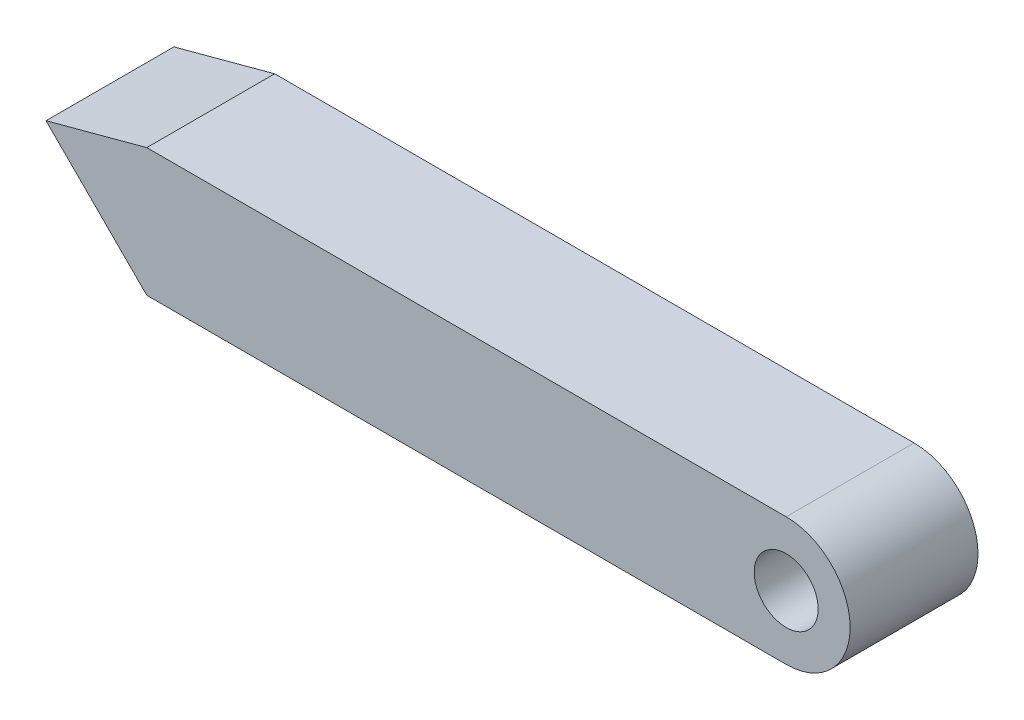
ISO-10303-21;
HEADER;
FILE_DESCRIPTION(('STEP AP214'),'2;1');
FILE_NAME('part.step','',(''),(''),'','','');
FILE_SCHEMA(('AUTOMOTIVE_DESIGN { 1 0 10303 214 1 1 1 1 }'));
ENDSEC;
DATA;
#1=APPLICATION_CONTEXT('core data for automotive mechanical design processes');
#2=APPLICATION_PROTOCOL_DEFINITION('international standard','automotive_design',2000,#1);
#3=PRODUCT_CONTEXT('',#1,'mechanical');
#4=PRODUCT('Part','Part','',(#3));
#5=PRODUCT_RELATED_PRODUCT_CATEGORY('part','',(#4));
#6=PRODUCT_DEFINITION_FORMATION('','',#4);
#7=PRODUCT_DEFINITION_CONTEXT('part definition',#1,'design');
#8=PRODUCT_DEFINITION('design','',#6,#7);
#9=PRODUCT_DEFINITION_SHAPE('','',#8);
#10=(LENGTH_UNIT() NAMED_UNIT(*) SI_UNIT(.MILLI.,.METRE.));
#11=(NAMED_UNIT(*) PLANE_ANGLE_UNIT() SI_UNIT($,.RADIAN.));
#12=(NAMED_UNIT(*) SI_UNIT($,.STERADIAN.) SOLID_ANGLE_UNIT());
#13=UNCERTAINTY_MEASURE_WITH_UNIT(LENGTH_MEASURE(1.E-05),#10,'distance_accuracy_value','');
#14=(GEOMETRIC_REPRESENTATION_CONTEXT(3) GLOBAL_UNCERTAINTY_ASSIGNED_CONTEXT((#13)) GLOBAL_UNIT_ASSIGNED_CONTEXT((#10,
#11,#12)) REPRESENTATION_CONTEXT('',''));
#15=CARTESIAN_POINT('',(0.,0.,0.));
#16=DIRECTION('',(0.,0.,1.));
#17=DIRECTION('',(1.,0.,0.));
#18=AXIS2_PLACEMENT_3D('',#15,#16,#17);
#19=CARTESIAN_POINT('',(0.,0.,10.));
#20=DIRECTION('',(0.,0.,1.));
#21=DIRECTION('',(1.,0.,0.));
#22=AXIS2_PLACEMENT_3D('',#19,#20,#21);
#23=PLANE('',#22);
#24=CARTESIAN_POINT('',(0.,0.,10.));
#25=DIRECTION('',(0.,0.,1.));
#26=DIRECTION('',(1.,0.,0.));
#27=AXIS2_PLACEMENT_3D('',#24,#25,#26);
#28=CIRCLE('',#27,5.);
#29=CARTESIAN_POINT('',(0.,-5.,10.));
#30=VERTEX_POINT('',#29);
#31=CARTESIAN_POINT('',(0.,5.,10.));
#32=VERTEX_POINT('',#31);
#33=EDGE_CURVE('E116',#30,#32,#28,.T.);
#34=ORIENTED_EDGE('',*,*,#33,.T.);
#35=DIRECTION('',(-1.,0.,0.));
#36=VECTOR('',#35,1.);
#37=CARTESIAN_POINT('',(0.,5.,10.));
#38=LINE('',#37,#36);
#39=CARTESIAN_POINT('',(-50.,4.99999999999999,10.));
#40=VERTEX_POINT('',#39);
#41=EDGE_CURVE('E83',#32,#40,#38,.T.);
#42=ORIENTED_EDGE('',*,*,#41,.T.);
#43=DIRECTION('',(-0.965682029009431,-0.259727200824689,0.));
#44=VECTOR('',#43,1.);
#45=CARTESIAN_POINT('',(-50.,4.99999999999999,10.));
#46=LINE('',#45,#44);
#47=CARTESIAN_POINT('',(-57.880486008255,2.88048600825499,10.));
#48=VERTEX_POINT('',#47);
#49=EDGE_CURVE('E87',#40,#48,#46,.T.);
#50=ORIENTED_EDGE('',*,*,#49,.T.);
#51=DIRECTION('',(0.707106781186547,-0.707106781186548,0.));
#52=VECTOR('',#51,1.);
#53=CARTESIAN_POINT('',(-50.,-5.,10.));
#54=LINE('',#53,#52);
#55=CARTESIAN_POINT('',(-50.,-5.,10.));
#56=VERTEX_POINT('',#55);
#57=EDGE_CURVE('E91',#48,#56,#54,.T.);
#58=ORIENTED_EDGE('',*,*,#57,.T.);
#59=DIRECTION('',(1.,0.,0.));
#60=VECTOR('',#59,1.);
#61=CARTESIAN_POINT('',(0.,-5.,10.));
#62=LINE('',#61,#60);
#63=EDGE_CURVE('E49',#56,#30,#62,.T.);
#64=ORIENTED_EDGE('',*,*,#63,.T.);
#65=EDGE_LOOP('',(#34,#42,#50,#58,#64));
#66=FACE_BOUND('',#65,.T.);
#67=CARTESIAN_POINT('',(0.,0.,10.));
#68=DIRECTION('',(0.,0.,1.));
#69=DIRECTION('',(1.,0.,0.));
#70=AXIS2_PLACEMENT_3D('',#67,#68,#69);
#71=CIRCLE('',#70,2.5);
#72=CARTESIAN_POINT('',(2.5,0.,10.));
#73=VERTEX_POINT('',#72);
#74=EDGE_CURVE('E111',#73,#73,#71,.T.);
#75=ORIENTED_EDGE('',*,*,#74,.F.);
#76=EDGE_LOOP('',(#75));
#77=FACE_BOUND('',#76,.T.);
#78=ADVANCED_FACE('F32',(#66,#77),#23,.T.);
#79=CARTESIAN_POINT('',(0.,0.,0.));
#80=DIRECTION('',(0.,0.,1.));
#81=DIRECTION('',(1.,0.,0.));
#82=AXIS2_PLACEMENT_3D('',#79,#80,#81);
#83=PLANE('',#82);
#84=CARTESIAN_POINT('',(0.,0.,0.));
#85=DIRECTION('',(0.,0.,1.));
#86=DIRECTION('',(1.,0.,0.));
#87=AXIS2_PLACEMENT_3D('',#84,#85,#86);
#88=CIRCLE('',#87,5.);
#89=CARTESIAN_POINT('',(0.,-5.,0.));
#90=VERTEX_POINT('',#89);
#91=CARTESIAN_POINT('',(0.,5.,0.));
#92=VERTEX_POINT('',#91);
#93=EDGE_CURVE('E107',#90,#92,#88,.T.);
#94=ORIENTED_EDGE('',*,*,#93,.F.);
#95=DIRECTION('',(1.,0.,0.));
#96=VECTOR('',#95,1.);
#97=CARTESIAN_POINT('',(0.,-5.,0.));
#98=LINE('',#97,#96);
#99=CARTESIAN_POINT('',(-50.,-5.,0.));
#100=VERTEX_POINT('',#99);
#101=EDGE_CURVE('E75',#100,#90,#98,.T.);
#102=ORIENTED_EDGE('',*,*,#101,.F.);
#103=DIRECTION('',(0.707106781186547,-0.707106781186548,0.));
#104=VECTOR('',#103,1.);
#105=CARTESIAN_POINT('',(-50.,-5.,0.));
#106=LINE('',#105,#104);
#107=CARTESIAN_POINT('',(-57.880486008255,2.88048600825499,0.));
#108=VERTEX_POINT('',#107);
#109=EDGE_CURVE('E69',#108,#100,#106,.T.);
#110=ORIENTED_EDGE('',*,*,#109,.F.);
#111=DIRECTION('',(-0.965682029009431,-0.259727200824689,0.));
#112=VECTOR('',#111,1.);
#113=CARTESIAN_POINT('',(-50.,4.99999999999999,0.));
#114=LINE('',#113,#112);
#115=CARTESIAN_POINT('',(-50.,4.99999999999999,0.));
#116=VERTEX_POINT('',#115);
#117=EDGE_CURVE('E98',#116,#108,#114,.T.);
#118=ORIENTED_EDGE('',*,*,#117,.F.);
#119=DIRECTION('',(-1.,0.,0.));
#120=VECTOR('',#119,1.);
#121=CARTESIAN_POINT('',(0.,5.,0.));
#122=LINE('',#121,#120);
#123=EDGE_CURVE('E110',#92,#116,#122,.T.);
#124=ORIENTED_EDGE('',*,*,#123,.F.);
#125=EDGE_LOOP('',(#94,#102,#110,#118,#124));
#126=FACE_BOUND('',#125,.T.);
#127=CARTESIAN_POINT('',(0.,0.,0.));
#128=DIRECTION('',(0.,0.,1.));
#129=DIRECTION('',(1.,0.,0.));
#130=AXIS2_PLACEMENT_3D('',#127,#128,#129);
#131=CIRCLE('',#130,2.5);
#132=CARTESIAN_POINT('',(2.5,0.,0.));
#133=VERTEX_POINT('',#132);
#134=EDGE_CURVE('E196',#133,#133,#131,.T.);
#135=ORIENTED_EDGE('',*,*,#134,.T.);
#136=EDGE_LOOP('',(#135));
#137=FACE_BOUND('',#136,.T.);
#138=ADVANCED_FACE('F120',(#126,#137),#83,.F.);
#139=CARTESIAN_POINT('',(0.,0.,10.));
#140=DIRECTION('',(0.,0.,-1.));
#141=DIRECTION('',(-1.,0.,0.));
#142=AXIS2_PLACEMENT_3D('',#139,#140,#141);
#143=CYLINDRICAL_SURFACE('',#142,5.);
#144=ORIENTED_EDGE('',*,*,#93,.T.);
#145=DIRECTION('',(0.,0.,-1.));
#146=VECTOR('',#145,1.);
#147=CARTESIAN_POINT('',(0.,5.,10.));
#148=LINE('',#147,#146);
#149=EDGE_CURVE('E11',#32,#92,#148,.T.);
#150=ORIENTED_EDGE('',*,*,#149,.F.);
#151=ORIENTED_EDGE('',*,*,#33,.F.);
#152=DIRECTION('',(0.,0.,-1.));
#153=VECTOR('',#152,1.);
#154=CARTESIAN_POINT('',(0.,-5.,10.));
#155=LINE('',#154,#153);
#156=EDGE_CURVE('E103',#30,#90,#155,.T.);
#157=ORIENTED_EDGE('',*,*,#156,.T.);
#158=EDGE_LOOP('',(#144,#150,#151,#157));
#159=FACE_BOUND('',#158,.T.);
#160=ADVANCED_FACE('F34',(#159),#143,.T.);
#161=CARTESIAN_POINT('',(0.,5.,10.));
#162=DIRECTION('',(0.,-1.,0.));
#163=DIRECTION('',(1.,0.,0.));
#164=AXIS2_PLACEMENT_3D('',#161,#162,#163);
#165=PLANE('',#164);
#166=ORIENTED_EDGE('',*,*,#123,.T.);
#167=DIRECTION('',(0.,0.,-1.));
#168=VECTOR('',#167,1.);
#169=CARTESIAN_POINT('',(-50.,4.99999999999999,10.));
#170=LINE('',#169,#168);
#171=EDGE_CURVE('E41',#40,#116,#170,.T.);
#172=ORIENTED_EDGE('',*,*,#171,.F.);
#173=ORIENTED_EDGE('',*,*,#41,.F.);
#174=ORIENTED_EDGE('',*,*,#149,.T.);
#175=EDGE_LOOP('',(#166,#172,#173,#174));
#176=FACE_BOUND('',#175,.T.);
#177=ADVANCED_FACE('F145',(#176),#165,.F.);
#178=CARTESIAN_POINT('',(-50.,4.99999999999999,10.));
#179=DIRECTION('',(0.259727200824689,-0.965682029009431,0.));
#180=DIRECTION('',(0.965682029009431,0.259727200824689,0.));
#181=AXIS2_PLACEMENT_3D('',#178,#179,#180);
#182=PLANE('',#181);
#183=ORIENTED_EDGE('',*,*,#117,.T.);
#184=DIRECTION('',(0.,0.,-1.));
#185=VECTOR('',#184,1.);
#186=CARTESIAN_POINT('',(-57.880486008255,2.88048600825499,10.));
#187=LINE('',#186,#185);
#188=EDGE_CURVE('E95',#48,#108,#187,.T.);
#189=ORIENTED_EDGE('',*,*,#188,.F.);
#190=ORIENTED_EDGE('',*,*,#49,.F.);
#191=ORIENTED_EDGE('',*,*,#171,.T.);
#192=EDGE_LOOP('',(#183,#189,#190,#191));
#193=FACE_BOUND('',#192,.T.);
#194=ADVANCED_FACE('F96',(#193),#182,.F.);
#195=CARTESIAN_POINT('',(-50.,-5.,10.));
#196=DIRECTION('',(0.707106781186548,0.707106781186547,0.));
#197=DIRECTION('',(-0.707106781186547,0.707106781186548,0.));
#198=AXIS2_PLACEMENT_3D('',#195,#196,#197);
#199=PLANE('',#198);
#200=ORIENTED_EDGE('',*,*,#109,.T.);
#201=DIRECTION('',(0.,0.,-1.));
#202=VECTOR('',#201,1.);
#203=CARTESIAN_POINT('',(-50.,-5.,10.));
#204=LINE('',#203,#202);
#205=EDGE_CURVE('E99',#56,#100,#204,.T.);
#206=ORIENTED_EDGE('',*,*,#205,.F.);
#207=ORIENTED_EDGE('',*,*,#57,.F.);
#208=ORIENTED_EDGE('',*,*,#188,.T.);
#209=EDGE_LOOP('',(#200,#206,#207,#208));
#210=FACE_BOUND('',#209,.T.);
#211=ADVANCED_FACE('F101',(#210),#199,.F.);
#212=CARTESIAN_POINT('',(0.,-5.,10.));
#213=DIRECTION('',(0.,1.,0.));
#214=DIRECTION('',(0.,0.,1.));
#215=AXIS2_PLACEMENT_3D('',#212,#213,#214);
#216=PLANE('',#215);
#217=ORIENTED_EDGE('',*,*,#101,.T.);
#218=ORIENTED_EDGE('',*,*,#156,.F.);
#219=ORIENTED_EDGE('',*,*,#63,.F.);
#220=ORIENTED_EDGE('',*,*,#205,.T.);
#221=EDGE_LOOP('',(#217,#218,#219,#220));
#222=FACE_BOUND('',#221,.T.);
#223=ADVANCED_FACE('F125',(#222),#216,.F.);
#224=CARTESIAN_POINT('',(0.,0.,10.));
#225=DIRECTION('',(0.,0.,-1.));
#226=DIRECTION('',(-1.,0.,0.));
#227=AXIS2_PLACEMENT_3D('',#224,#225,#226);
#228=CYLINDRICAL_SURFACE('',#227,2.5);
#229=ORIENTED_EDGE('',*,*,#74,.T.);
#230=EDGE_LOOP('',(#229));
#231=FACE_BOUND('',#230,.T.);
#232=ORIENTED_EDGE('',*,*,#134,.F.);
#233=EDGE_LOOP('',(#232));
#234=FACE_BOUND('',#233,.T.);
#235=ADVANCED_FACE('F127',(#231,#234),#228,.F.);
#236=CLOSED_SHELL('',(#78,#138,#160,#177,#194,#211,#223,#235));
#237=MANIFOLD_SOLID_BREP('B2',#236);
#238=ADVANCED_BREP_SHAPE_REPRESENTATION('',(#18,#237),#14);
#239=SHAPE_DEFINITION_REPRESENTATION(#9,#238);
ENDSEC;
END-ISO-10303-21;
